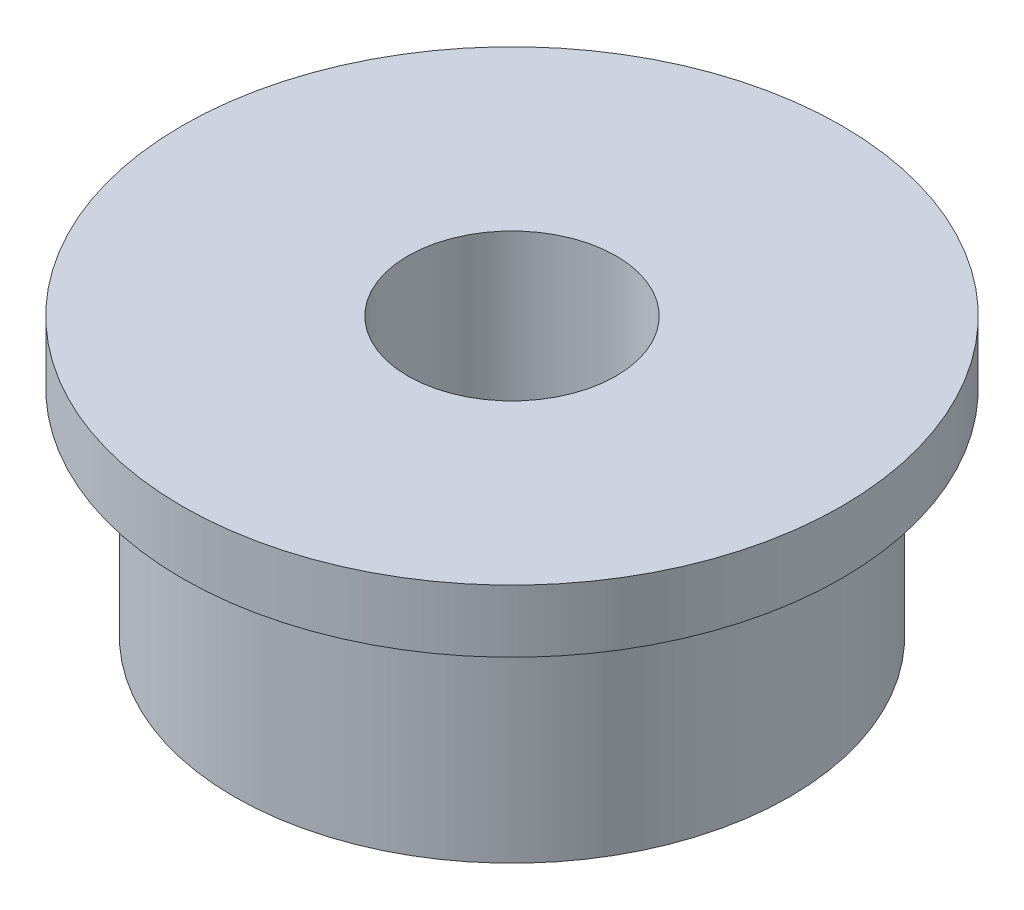
ISO-10303-21;
HEADER;
FILE_DESCRIPTION(('STEP AP214'),'2;1');
FILE_NAME('part.step','',(''),(''),'','','');
FILE_SCHEMA(('AUTOMOTIVE_DESIGN { 1 0 10303 214 1 1 1 1 }'));
ENDSEC;
DATA;
#1=APPLICATION_CONTEXT('core data for automotive mechanical design processes');
#2=APPLICATION_PROTOCOL_DEFINITION('international standard','automotive_design',2000,#1);
#3=PRODUCT_CONTEXT('',#1,'mechanical');
#4=PRODUCT('Part','Part','',(#3));
#5=PRODUCT_RELATED_PRODUCT_CATEGORY('part','',(#4));
#6=PRODUCT_DEFINITION_FORMATION('','',#4);
#7=PRODUCT_DEFINITION_CONTEXT('part definition',#1,'design');
#8=PRODUCT_DEFINITION('design','',#6,#7);
#9=PRODUCT_DEFINITION_SHAPE('','',#8);
#10=(LENGTH_UNIT() NAMED_UNIT(*) SI_UNIT(.MILLI.,.METRE.));
#11=(NAMED_UNIT(*) PLANE_ANGLE_UNIT() SI_UNIT($,.RADIAN.));
#12=(NAMED_UNIT(*) SI_UNIT($,.STERADIAN.) SOLID_ANGLE_UNIT());
#13=UNCERTAINTY_MEASURE_WITH_UNIT(LENGTH_MEASURE(1.E-05),#10,'distance_accuracy_value','');
#14=(GEOMETRIC_REPRESENTATION_CONTEXT(3) GLOBAL_UNCERTAINTY_ASSIGNED_CONTEXT((#13)) GLOBAL_UNIT_ASSIGNED_CONTEXT((#10,
#11,#12)) REPRESENTATION_CONTEXT('',''));
#15=CARTESIAN_POINT('',(0.,0.,0.));
#16=DIRECTION('',(0.,0.,1.));
#17=DIRECTION('',(1.,0.,0.));
#18=AXIS2_PLACEMENT_3D('',#15,#16,#17);
#19=CARTESIAN_POINT('',(0.,4.,0.));
#20=DIRECTION('',(0.,-1.,0.));
#21=DIRECTION('',(0.,0.,-1.));
#22=AXIS2_PLACEMENT_3D('',#19,#20,#21);
#23=CYLINDRICAL_SURFACE('',#22,4.);
#24=CARTESIAN_POINT('',(0.,0.,0.));
#25=DIRECTION('',(0.,1.,0.));
#26=DIRECTION('',(0.,0.,1.));
#27=AXIS2_PLACEMENT_3D('',#24,#25,#26);
#28=CIRCLE('',#27,4.);
#29=CARTESIAN_POINT('',(0.,0.,4.));
#30=VERTEX_POINT('',#29);
#31=EDGE_CURVE('E35',#30,#30,#28,.T.);
#32=ORIENTED_EDGE('',*,*,#31,.T.);
#33=EDGE_LOOP('',(#32));
#34=FACE_BOUND('',#33,.T.);
#35=CARTESIAN_POINT('',(0.,3.1,0.));
#36=DIRECTION('',(0.,1.,0.));
#37=DIRECTION('',(0.,0.,1.));
#38=AXIS2_PLACEMENT_3D('',#35,#36,#37);
#39=CIRCLE('',#38,4.);
#40=CARTESIAN_POINT('',(0.,3.1,4.));
#41=VERTEX_POINT('',#40);
#42=EDGE_CURVE('E10',#41,#41,#39,.T.);
#43=ORIENTED_EDGE('',*,*,#42,.F.);
#44=EDGE_LOOP('',(#43));
#45=FACE_BOUND('',#44,.T.);
#46=ADVANCED_FACE('F32',(#34,#45),#23,.T.);
#47=CARTESIAN_POINT('',(0.,4.,0.));
#48=DIRECTION('',(0.,1.,0.));
#49=DIRECTION('',(0.,0.,1.));
#50=AXIS2_PLACEMENT_3D('',#47,#48,#49);
#51=PLANE('',#50);
#52=CARTESIAN_POINT('',(0.,4.,0.));
#53=DIRECTION('',(0.,1.,0.));
#54=DIRECTION('',(0.,0.,1.));
#55=AXIS2_PLACEMENT_3D('',#52,#53,#54);
#56=CIRCLE('',#55,1.5);
#57=CARTESIAN_POINT('',(0.,4.,1.5));
#58=VERTEX_POINT('',#57);
#59=EDGE_CURVE('E43',#58,#58,#56,.T.);
#60=ORIENTED_EDGE('',*,*,#59,.F.);
#61=EDGE_LOOP('',(#60));
#62=FACE_BOUND('',#61,.T.);
#63=CARTESIAN_POINT('',(0.,4.,0.));
#64=DIRECTION('',(0.,1.,0.));
#65=DIRECTION('',(0.,0.,1.));
#66=AXIS2_PLACEMENT_3D('',#63,#64,#65);
#67=CIRCLE('',#66,4.75);
#68=CARTESIAN_POINT('',(0.,4.,4.75));
#69=VERTEX_POINT('',#68);
#70=EDGE_CURVE('E46',#69,#69,#67,.T.);
#71=ORIENTED_EDGE('',*,*,#70,.T.);
#72=EDGE_LOOP('',(#71));
#73=FACE_BOUND('',#72,.T.);
#74=ADVANCED_FACE('F60',(#62,#73),#51,.T.);
#75=CARTESIAN_POINT('',(0.,0.,0.));
#76=DIRECTION('',(0.,1.,0.));
#77=DIRECTION('',(0.,0.,1.));
#78=AXIS2_PLACEMENT_3D('',#75,#76,#77);
#79=PLANE('',#78);
#80=ORIENTED_EDGE('',*,*,#31,.F.);
#81=EDGE_LOOP('',(#80));
#82=FACE_BOUND('',#81,.T.);
#83=CARTESIAN_POINT('',(0.,0.,0.));
#84=DIRECTION('',(0.,1.,0.));
#85=DIRECTION('',(0.,0.,1.));
#86=AXIS2_PLACEMENT_3D('',#83,#84,#85);
#87=CIRCLE('',#86,1.5);
#88=CARTESIAN_POINT('',(0.,0.,1.5));
#89=VERTEX_POINT('',#88);
#90=EDGE_CURVE('E49',#89,#89,#87,.T.);
#91=ORIENTED_EDGE('',*,*,#90,.T.);
#92=EDGE_LOOP('',(#91));
#93=FACE_BOUND('',#92,.T.);
#94=ADVANCED_FACE('F78',(#82,#93),#79,.F.);
#95=CARTESIAN_POINT('',(0.,4.,0.));
#96=DIRECTION('',(0.,-1.,0.));
#97=DIRECTION('',(0.,0.,-1.));
#98=AXIS2_PLACEMENT_3D('',#95,#96,#97);
#99=CYLINDRICAL_SURFACE('',#98,1.5);
#100=ORIENTED_EDGE('',*,*,#59,.T.);
#101=EDGE_LOOP('',(#100));
#102=FACE_BOUND('',#101,.T.);
#103=ORIENTED_EDGE('',*,*,#90,.F.);
#104=EDGE_LOOP('',(#103));
#105=FACE_BOUND('',#104,.T.);
#106=ADVANCED_FACE('F69',(#102,#105),#99,.F.);
#107=CARTESIAN_POINT('',(0.,3.1,0.));
#108=DIRECTION('',(0.,1.,0.));
#109=DIRECTION('',(0.,0.,1.));
#110=AXIS2_PLACEMENT_3D('',#107,#108,#109);
#111=PLANE('',#110);
#112=CARTESIAN_POINT('',(0.,3.1,0.));
#113=DIRECTION('',(0.,1.,0.));
#114=DIRECTION('',(0.,0.,1.));
#115=AXIS2_PLACEMENT_3D('',#112,#113,#114);
#116=CIRCLE('',#115,4.75);
#117=CARTESIAN_POINT('',(0.,3.1,4.75));
#118=VERTEX_POINT('',#117);
#119=EDGE_CURVE('E51',#118,#118,#116,.T.);
#120=ORIENTED_EDGE('',*,*,#119,.F.);
#121=EDGE_LOOP('',(#120));
#122=FACE_BOUND('',#121,.T.);
#123=ORIENTED_EDGE('',*,*,#42,.T.);
#124=EDGE_LOOP('',(#123));
#125=FACE_BOUND('',#124,.T.);
#126=ADVANCED_FACE('F64',(#122,#125),#111,.F.);
#127=CARTESIAN_POINT('',(0.,3.1,0.));
#128=DIRECTION('',(0.,1.,0.));
#129=DIRECTION('',(0.,0.,1.));
#130=AXIS2_PLACEMENT_3D('',#127,#128,#129);
#131=CYLINDRICAL_SURFACE('',#130,4.75);
#132=ORIENTED_EDGE('',*,*,#119,.T.);
#133=EDGE_LOOP('',(#132));
#134=FACE_BOUND('',#133,.T.);
#135=ORIENTED_EDGE('',*,*,#70,.F.);
#136=EDGE_LOOP('',(#135));
#137=FACE_BOUND('',#136,.T.);
#138=ADVANCED_FACE('F62',(#134,#137),#131,.T.);
#139=CLOSED_SHELL('',(#46,#74,#94,#106,#126,#138));
#140=MANIFOLD_SOLID_BREP('B2',#139);
#141=ADVANCED_BREP_SHAPE_REPRESENTATION('',(#18,#140),#14);
#142=SHAPE_DEFINITION_REPRESENTATION(#9,#141);
ENDSEC;
END-ISO-10303-21;
